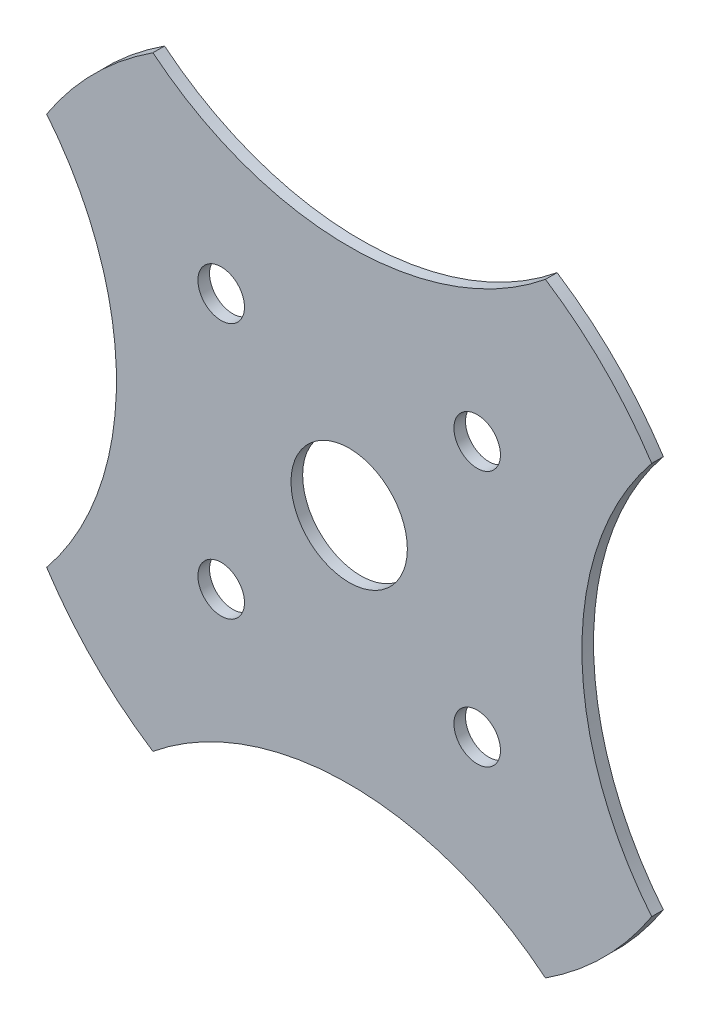
ISO-10303-21;
HEADER;
FILE_DESCRIPTION(('STEP AP214'),'2;1');
FILE_NAME('part.step','',(''),(''),'','','');
FILE_SCHEMA(('AUTOMOTIVE_DESIGN { 1 0 10303 214 1 1 1 1 }'));
ENDSEC;
DATA;
#1=APPLICATION_CONTEXT('core data for automotive mechanical design processes');
#2=APPLICATION_PROTOCOL_DEFINITION('international standard','automotive_design',2000,#1);
#3=PRODUCT_CONTEXT('',#1,'mechanical');
#4=PRODUCT('Part','Part','',(#3));
#5=PRODUCT_RELATED_PRODUCT_CATEGORY('part','',(#4));
#6=PRODUCT_DEFINITION_FORMATION('','',#4);
#7=PRODUCT_DEFINITION_CONTEXT('part definition',#1,'design');
#8=PRODUCT_DEFINITION('design','',#6,#7);
#9=PRODUCT_DEFINITION_SHAPE('','',#8);
#10=(LENGTH_UNIT() NAMED_UNIT(*) SI_UNIT(.MILLI.,.METRE.));
#11=(NAMED_UNIT(*) PLANE_ANGLE_UNIT() SI_UNIT($,.RADIAN.));
#12=(NAMED_UNIT(*) SI_UNIT($,.STERADIAN.) SOLID_ANGLE_UNIT());
#13=UNCERTAINTY_MEASURE_WITH_UNIT(LENGTH_MEASURE(1.E-05),#10,'distance_accuracy_value','');
#14=(GEOMETRIC_REPRESENTATION_CONTEXT(3) GLOBAL_UNCERTAINTY_ASSIGNED_CONTEXT((#13)) GLOBAL_UNIT_ASSIGNED_CONTEXT((#10,
#11,#12)) REPRESENTATION_CONTEXT('',''));
#15=CARTESIAN_POINT('',(0.,0.,0.));
#16=DIRECTION('',(0.,0.,1.));
#17=DIRECTION('',(1.,0.,0.));
#18=AXIS2_PLACEMENT_3D('',#15,#16,#17);
#19=CARTESIAN_POINT('',(0.,0.,-3.175));
#20=DIRECTION('',(0.,0.,1.));
#21=DIRECTION('',(1.,0.,0.));
#22=AXIS2_PLACEMENT_3D('',#19,#20,#21);
#23=CYLINDRICAL_SURFACE('',#22,98.3996);
#24=CARTESIAN_POINT('',(0.,0.,0.));
#25=DIRECTION('',(0.,0.,1.));
#26=DIRECTION('',(1.,0.,0.));
#27=AXIS2_PLACEMENT_3D('',#24,#25,#26);
#28=CIRCLE('',#27,98.3996);
#29=CARTESIAN_POINT('',(82.55,53.5535132382554,0.));
#30=VERTEX_POINT('',#29);
#31=CARTESIAN_POINT('',(53.5535132382553,82.5500000000001,0.));
#32=VERTEX_POINT('',#31);
#33=EDGE_CURVE('E128',#30,#32,#28,.T.);
#34=ORIENTED_EDGE('',*,*,#33,.F.);
#35=DIRECTION('',(0.,0.,1.));
#36=VECTOR('',#35,1.);
#37=CARTESIAN_POINT('',(82.55,53.5535132382554,-3.175));
#38=LINE('',#37,#36);
#39=CARTESIAN_POINT('',(82.55,53.5535132382554,-3.175));
#40=VERTEX_POINT('',#39);
#41=EDGE_CURVE('E11',#40,#30,#38,.T.);
#42=ORIENTED_EDGE('',*,*,#41,.F.);
#43=CARTESIAN_POINT('',(0.,0.,-3.175));
#44=DIRECTION('',(0.,0.,1.));
#45=DIRECTION('',(1.,0.,0.));
#46=AXIS2_PLACEMENT_3D('',#43,#44,#45);
#47=CIRCLE('',#46,98.3996);
#48=CARTESIAN_POINT('',(53.5535132382553,82.5500000000001,-3.175));
#49=VERTEX_POINT('',#48);
#50=EDGE_CURVE('E149',#40,#49,#47,.T.);
#51=ORIENTED_EDGE('',*,*,#50,.T.);
#52=DIRECTION('',(0.,0.,1.));
#53=VECTOR('',#52,1.);
#54=CARTESIAN_POINT('',(53.5535132382553,82.5500000000001,-3.175));
#55=LINE('',#54,#53);
#56=EDGE_CURVE('E34',#49,#32,#55,.T.);
#57=ORIENTED_EDGE('',*,*,#56,.T.);
#58=EDGE_LOOP('',(#34,#42,#51,#57));
#59=FACE_BOUND('',#58,.T.);
#60=ADVANCED_FACE('F31',(#59),#23,.T.);
#61=CARTESIAN_POINT('',(148.3000336,0.,-3.175));
#62=DIRECTION('',(0.,0.,1.));
#63=DIRECTION('',(1.,0.,0.));
#64=AXIS2_PLACEMENT_3D('',#61,#62,#63);
#65=CYLINDRICAL_SURFACE('',#64,84.8000335999997);
#66=CARTESIAN_POINT('',(148.3000336,0.,0.));
#67=DIRECTION('',(0.,0.,-1.));
#68=DIRECTION('',(1.,0.,0.));
#69=AXIS2_PLACEMENT_3D('',#66,#67,#68);
#70=CIRCLE('',#69,84.8000335999997);
#71=CARTESIAN_POINT('',(82.55,-53.5535132382553,0.));
#72=VERTEX_POINT('',#71);
#73=EDGE_CURVE('E147',#72,#30,#70,.T.);
#74=ORIENTED_EDGE('',*,*,#73,.F.);
#75=DIRECTION('',(0.,0.,1.));
#76=VECTOR('',#75,1.);
#77=CARTESIAN_POINT('',(82.55,-53.5535132382553,-3.175));
#78=LINE('',#77,#76);
#79=CARTESIAN_POINT('',(82.55,-53.5535132382553,-3.175));
#80=VERTEX_POINT('',#79);
#81=EDGE_CURVE('E40',#80,#72,#78,.T.);
#82=ORIENTED_EDGE('',*,*,#81,.F.);
#83=CARTESIAN_POINT('',(148.3000336,0.,-3.175));
#84=DIRECTION('',(0.,0.,-1.));
#85=DIRECTION('',(1.,0.,0.));
#86=AXIS2_PLACEMENT_3D('',#83,#84,#85);
#87=CIRCLE('',#86,84.8000335999997);
#88=EDGE_CURVE('E118',#80,#40,#87,.T.);
#89=ORIENTED_EDGE('',*,*,#88,.T.);
#90=ORIENTED_EDGE('',*,*,#41,.T.);
#91=EDGE_LOOP('',(#74,#82,#89,#90));
#92=FACE_BOUND('',#91,.T.);
#93=ADVANCED_FACE('F161',(#92),#65,.F.);
#94=CARTESIAN_POINT('',(0.,0.,-3.175));
#95=DIRECTION('',(0.,0.,1.));
#96=DIRECTION('',(1.,0.,0.));
#97=AXIS2_PLACEMENT_3D('',#94,#95,#96);
#98=CYLINDRICAL_SURFACE('',#97,98.3995999999999);
#99=CARTESIAN_POINT('',(0.,0.,0.));
#100=DIRECTION('',(0.,0.,1.));
#101=DIRECTION('',(1.,0.,0.));
#102=AXIS2_PLACEMENT_3D('',#99,#100,#101);
#103=CIRCLE('',#102,98.3995999999999);
#104=CARTESIAN_POINT('',(53.5535132382553,-82.55,0.));
#105=VERTEX_POINT('',#104);
#106=EDGE_CURVE('E105',#105,#72,#103,.T.);
#107=ORIENTED_EDGE('',*,*,#106,.F.);
#108=DIRECTION('',(0.,0.,1.));
#109=VECTOR('',#108,1.);
#110=CARTESIAN_POINT('',(53.5535132382553,-82.55,-3.175));
#111=LINE('',#110,#109);
#112=CARTESIAN_POINT('',(53.5535132382553,-82.55,-3.175));
#113=VERTEX_POINT('',#112);
#114=EDGE_CURVE('E100',#113,#105,#111,.T.);
#115=ORIENTED_EDGE('',*,*,#114,.F.);
#116=CARTESIAN_POINT('',(0.,0.,-3.175));
#117=DIRECTION('',(0.,0.,1.));
#118=DIRECTION('',(1.,0.,0.));
#119=AXIS2_PLACEMENT_3D('',#116,#117,#118);
#120=CIRCLE('',#119,98.3995999999999);
#121=EDGE_CURVE('E103',#113,#80,#120,.T.);
#122=ORIENTED_EDGE('',*,*,#121,.T.);
#123=ORIENTED_EDGE('',*,*,#81,.T.);
#124=EDGE_LOOP('',(#107,#115,#122,#123));
#125=FACE_BOUND('',#124,.T.);
#126=ADVANCED_FACE('F102',(#125),#98,.T.);
#127=CARTESIAN_POINT('',(0.,-148.3000336,-3.175));
#128=DIRECTION('',(0.,0.,1.));
#129=DIRECTION('',(1.,0.,0.));
#130=AXIS2_PLACEMENT_3D('',#127,#128,#129);
#131=CYLINDRICAL_SURFACE('',#130,84.8000335999997);
#132=CARTESIAN_POINT('',(0.,-148.3000336,0.));
#133=DIRECTION('',(0.,0.,-1.));
#134=DIRECTION('',(-1.,0.,0.));
#135=AXIS2_PLACEMENT_3D('',#132,#133,#134);
#136=CIRCLE('',#135,84.8000335999997);
#137=CARTESIAN_POINT('',(-53.5535132382553,-82.55,0.));
#138=VERTEX_POINT('',#137);
#139=EDGE_CURVE('E144',#138,#105,#136,.T.);
#140=ORIENTED_EDGE('',*,*,#139,.F.);
#141=DIRECTION('',(0.,0.,1.));
#142=VECTOR('',#141,1.);
#143=CARTESIAN_POINT('',(-53.5535132382553,-82.55,-3.175));
#144=LINE('',#143,#142);
#145=CARTESIAN_POINT('',(-53.5535132382553,-82.55,-3.175));
#146=VERTEX_POINT('',#145);
#147=EDGE_CURVE('E110',#146,#138,#144,.T.);
#148=ORIENTED_EDGE('',*,*,#147,.F.);
#149=CARTESIAN_POINT('',(0.,-148.3000336,-3.175));
#150=DIRECTION('',(0.,0.,-1.));
#151=DIRECTION('',(-1.,0.,0.));
#152=AXIS2_PLACEMENT_3D('',#149,#150,#151);
#153=CIRCLE('',#152,84.8000335999997);
#154=EDGE_CURVE('E116',#146,#113,#153,.T.);
#155=ORIENTED_EDGE('',*,*,#154,.T.);
#156=ORIENTED_EDGE('',*,*,#114,.T.);
#157=EDGE_LOOP('',(#140,#148,#155,#156));
#158=FACE_BOUND('',#157,.T.);
#159=ADVANCED_FACE('F120',(#158),#131,.F.);
#160=CARTESIAN_POINT('',(0.,0.,-3.175));
#161=DIRECTION('',(0.,0.,1.));
#162=DIRECTION('',(1.,0.,0.));
#163=AXIS2_PLACEMENT_3D('',#160,#161,#162);
#164=CYLINDRICAL_SURFACE('',#163,98.3995999999999);
#165=CARTESIAN_POINT('',(0.,0.,0.));
#166=DIRECTION('',(0.,0.,1.));
#167=DIRECTION('',(1.,0.,0.));
#168=AXIS2_PLACEMENT_3D('',#165,#166,#167);
#169=CIRCLE('',#168,98.3995999999999);
#170=CARTESIAN_POINT('',(-82.55,-53.5535132382553,0.));
#171=VERTEX_POINT('',#170);
#172=EDGE_CURVE('E141',#171,#138,#169,.T.);
#173=ORIENTED_EDGE('',*,*,#172,.F.);
#174=DIRECTION('',(0.,0.,1.));
#175=VECTOR('',#174,1.);
#176=CARTESIAN_POINT('',(-82.55,-53.5535132382553,-3.175));
#177=LINE('',#176,#175);
#178=CARTESIAN_POINT('',(-82.55,-53.5535132382553,-3.175));
#179=VERTEX_POINT('',#178);
#180=EDGE_CURVE('E153',#179,#171,#177,.T.);
#181=ORIENTED_EDGE('',*,*,#180,.F.);
#182=CARTESIAN_POINT('',(0.,0.,-3.175));
#183=DIRECTION('',(0.,0.,1.));
#184=DIRECTION('',(1.,0.,0.));
#185=AXIS2_PLACEMENT_3D('',#182,#183,#184);
#186=CIRCLE('',#185,98.3995999999999);
#187=EDGE_CURVE('E121',#179,#146,#186,.T.);
#188=ORIENTED_EDGE('',*,*,#187,.T.);
#189=ORIENTED_EDGE('',*,*,#147,.T.);
#190=EDGE_LOOP('',(#173,#181,#188,#189));
#191=FACE_BOUND('',#190,.T.);
#192=ADVANCED_FACE('F174',(#191),#164,.T.);
#193=CARTESIAN_POINT('',(-148.3000336,0.,-3.175));
#194=DIRECTION('',(0.,0.,1.));
#195=DIRECTION('',(1.,0.,0.));
#196=AXIS2_PLACEMENT_3D('',#193,#194,#195);
#197=CYLINDRICAL_SURFACE('',#196,84.8000335999997);
#198=CARTESIAN_POINT('',(-148.3000336,0.,0.));
#199=DIRECTION('',(0.,0.,-1.));
#200=DIRECTION('',(-1.,0.,0.));
#201=AXIS2_PLACEMENT_3D('',#198,#199,#200);
#202=CIRCLE('',#201,84.8000335999997);
#203=CARTESIAN_POINT('',(-82.55,53.5535132382554,0.));
#204=VERTEX_POINT('',#203);
#205=EDGE_CURVE('E138',#204,#171,#202,.T.);
#206=ORIENTED_EDGE('',*,*,#205,.F.);
#207=DIRECTION('',(0.,0.,1.));
#208=VECTOR('',#207,1.);
#209=CARTESIAN_POINT('',(-82.55,53.5535132382554,-3.175));
#210=LINE('',#209,#208);
#211=CARTESIAN_POINT('',(-82.55,53.5535132382554,-3.175));
#212=VERTEX_POINT('',#211);
#213=EDGE_CURVE('E155',#212,#204,#210,.T.);
#214=ORIENTED_EDGE('',*,*,#213,.F.);
#215=CARTESIAN_POINT('',(-148.3000336,0.,-3.175));
#216=DIRECTION('',(0.,0.,-1.));
#217=DIRECTION('',(-1.,0.,0.));
#218=AXIS2_PLACEMENT_3D('',#215,#216,#217);
#219=CIRCLE('',#218,84.8000335999997);
#220=EDGE_CURVE('E123',#212,#179,#219,.T.);
#221=ORIENTED_EDGE('',*,*,#220,.T.);
#222=ORIENTED_EDGE('',*,*,#180,.T.);
#223=EDGE_LOOP('',(#206,#214,#221,#222));
#224=FACE_BOUND('',#223,.T.);
#225=ADVANCED_FACE('F177',(#224),#197,.F.);
#226=CARTESIAN_POINT('',(0.,0.,-3.175));
#227=DIRECTION('',(0.,0.,1.));
#228=DIRECTION('',(1.,0.,0.));
#229=AXIS2_PLACEMENT_3D('',#226,#227,#228);
#230=CYLINDRICAL_SURFACE('',#229,98.3996);
#231=CARTESIAN_POINT('',(0.,0.,0.));
#232=DIRECTION('',(0.,0.,1.));
#233=DIRECTION('',(-1.,0.,0.));
#234=AXIS2_PLACEMENT_3D('',#231,#232,#233);
#235=CIRCLE('',#234,98.3996);
#236=CARTESIAN_POINT('',(-53.5535132382554,82.55,0.));
#237=VERTEX_POINT('',#236);
#238=EDGE_CURVE('E135',#237,#204,#235,.T.);
#239=ORIENTED_EDGE('',*,*,#238,.F.);
#240=DIRECTION('',(0.,0.,1.));
#241=VECTOR('',#240,1.);
#242=CARTESIAN_POINT('',(-53.5535132382554,82.55,-3.175));
#243=LINE('',#242,#241);
#244=CARTESIAN_POINT('',(-53.5535132382554,82.55,-3.175));
#245=VERTEX_POINT('',#244);
#246=EDGE_CURVE('E156',#245,#237,#243,.T.);
#247=ORIENTED_EDGE('',*,*,#246,.F.);
#248=CARTESIAN_POINT('',(0.,0.,-3.175));
#249=DIRECTION('',(0.,0.,1.));
#250=DIRECTION('',(-1.,0.,0.));
#251=AXIS2_PLACEMENT_3D('',#248,#249,#250);
#252=CIRCLE('',#251,98.3996);
#253=EDGE_CURVE('E253',#245,#212,#252,.T.);
#254=ORIENTED_EDGE('',*,*,#253,.T.);
#255=ORIENTED_EDGE('',*,*,#213,.T.);
#256=EDGE_LOOP('',(#239,#247,#254,#255));
#257=FACE_BOUND('',#256,.T.);
#258=ADVANCED_FACE('F181',(#257),#230,.T.);
#259=CARTESIAN_POINT('',(0.,148.3000336,-3.175));
#260=DIRECTION('',(0.,0.,1.));
#261=DIRECTION('',(1.,0.,0.));
#262=AXIS2_PLACEMENT_3D('',#259,#260,#261);
#263=CYLINDRICAL_SURFACE('',#262,84.8000335999997);
#264=CARTESIAN_POINT('',(0.,148.3000336,0.));
#265=DIRECTION('',(0.,0.,-1.));
#266=DIRECTION('',(1.,0.,0.));
#267=AXIS2_PLACEMENT_3D('',#264,#265,#266);
#268=CIRCLE('',#267,84.8000335999997);
#269=EDGE_CURVE('E131',#32,#237,#268,.T.);
#270=ORIENTED_EDGE('',*,*,#269,.F.);
#271=ORIENTED_EDGE('',*,*,#56,.F.);
#272=CARTESIAN_POINT('',(0.,148.3000336,-3.175));
#273=DIRECTION('',(0.,0.,-1.));
#274=DIRECTION('',(1.,0.,0.));
#275=AXIS2_PLACEMENT_3D('',#272,#273,#274);
#276=CIRCLE('',#275,84.8000335999997);
#277=EDGE_CURVE('E251',#49,#245,#276,.T.);
#278=ORIENTED_EDGE('',*,*,#277,.T.);
#279=ORIENTED_EDGE('',*,*,#246,.T.);
#280=EDGE_LOOP('',(#270,#271,#278,#279));
#281=FACE_BOUND('',#280,.T.);
#282=ADVANCED_FACE('F158',(#281),#263,.F.);
#283=CARTESIAN_POINT('',(0.,74.1500167999999,-3.175));
#284=DIRECTION('',(0.,0.,1.));
#285=DIRECTION('',(1.,0.,0.));
#286=AXIS2_PLACEMENT_3D('',#283,#284,#285);
#287=PLANE('',#286);
#288=CARTESIAN_POINT('',(0.,0.,-3.175));
#289=DIRECTION('',(0.,0.,-1.));
#290=DIRECTION('',(-1.,0.,0.));
#291=AXIS2_PLACEMENT_3D('',#288,#289,#290);
#292=CIRCLE('',#291,15.875);
#293=CARTESIAN_POINT('',(-15.875,0.,-3.175));
#294=VERTEX_POINT('',#293);
#295=EDGE_CURVE('E223',#294,#294,#292,.T.);
#296=ORIENTED_EDGE('',*,*,#295,.F.);
#297=EDGE_LOOP('',(#296));
#298=FACE_BOUND('',#297,.T.);
#299=CARTESIAN_POINT('',(34.925,-34.925,-3.175));
#300=DIRECTION('',(0.,0.,-1.));
#301=DIRECTION('',(-1.,0.,0.));
#302=AXIS2_PLACEMENT_3D('',#299,#300,#301);
#303=CIRCLE('',#302,6.35);
#304=CARTESIAN_POINT('',(28.575,-34.925,-3.175));
#305=VERTEX_POINT('',#304);
#306=EDGE_CURVE('E227',#305,#305,#303,.T.);
#307=ORIENTED_EDGE('',*,*,#306,.F.);
#308=EDGE_LOOP('',(#307));
#309=FACE_BOUND('',#308,.T.);
#310=CARTESIAN_POINT('',(-34.925,-34.925,-3.175));
#311=DIRECTION('',(0.,0.,-1.));
#312=DIRECTION('',(-1.,0.,0.));
#313=AXIS2_PLACEMENT_3D('',#310,#311,#312);
#314=CIRCLE('',#313,6.35);
#315=CARTESIAN_POINT('',(-41.275,-34.925,-3.175));
#316=VERTEX_POINT('',#315);
#317=EDGE_CURVE('E234',#316,#316,#314,.T.);
#318=ORIENTED_EDGE('',*,*,#317,.F.);
#319=EDGE_LOOP('',(#318));
#320=FACE_BOUND('',#319,.T.);
#321=CARTESIAN_POINT('',(-34.925,34.925,-3.175));
#322=DIRECTION('',(0.,0.,-1.));
#323=DIRECTION('',(-1.,0.,0.));
#324=AXIS2_PLACEMENT_3D('',#321,#322,#323);
#325=CIRCLE('',#324,6.35);
#326=CARTESIAN_POINT('',(-41.275,34.925,-3.175));
#327=VERTEX_POINT('',#326);
#328=EDGE_CURVE('E240',#327,#327,#325,.T.);
#329=ORIENTED_EDGE('',*,*,#328,.F.);
#330=EDGE_LOOP('',(#329));
#331=FACE_BOUND('',#330,.T.);
#332=CARTESIAN_POINT('',(34.925,34.925,-3.175));
#333=DIRECTION('',(0.,0.,-1.));
#334=DIRECTION('',(-1.,0.,0.));
#335=AXIS2_PLACEMENT_3D('',#332,#333,#334);
#336=CIRCLE('',#335,6.35);
#337=CARTESIAN_POINT('',(28.575,34.925,-3.175));
#338=VERTEX_POINT('',#337);
#339=EDGE_CURVE('E132',#338,#338,#336,.T.);
#340=ORIENTED_EDGE('',*,*,#339,.F.);
#341=EDGE_LOOP('',(#340));
#342=FACE_BOUND('',#341,.T.);
#343=ORIENTED_EDGE('',*,*,#50,.F.);
#344=ORIENTED_EDGE('',*,*,#88,.F.);
#345=ORIENTED_EDGE('',*,*,#121,.F.);
#346=ORIENTED_EDGE('',*,*,#154,.F.);
#347=ORIENTED_EDGE('',*,*,#187,.F.);
#348=ORIENTED_EDGE('',*,*,#220,.F.);
#349=ORIENTED_EDGE('',*,*,#253,.F.);
#350=ORIENTED_EDGE('',*,*,#277,.F.);
#351=EDGE_LOOP('',(#343,#344,#345,#346,#347,#348,#349,#350));
#352=FACE_BOUND('',#351,.T.);
#353=ADVANCED_FACE('F114',(#298,#309,#320,#331,#342,#352),#287,.F.);
#354=CARTESIAN_POINT('',(0.,74.1500167999999,0.));
#355=DIRECTION('',(0.,0.,1.));
#356=DIRECTION('',(1.,0.,0.));
#357=AXIS2_PLACEMENT_3D('',#354,#355,#356);
#358=PLANE('',#357);
#359=CARTESIAN_POINT('',(0.,0.,0.));
#360=DIRECTION('',(0.,0.,1.));
#361=DIRECTION('',(1.,0.,0.));
#362=AXIS2_PLACEMENT_3D('',#359,#360,#361);
#363=CIRCLE('',#362,15.875);
#364=CARTESIAN_POINT('',(15.875,0.,0.));
#365=VERTEX_POINT('',#364);
#366=EDGE_CURVE('E221',#365,#365,#363,.F.);
#367=ORIENTED_EDGE('',*,*,#366,.T.);
#368=EDGE_LOOP('',(#367));
#369=FACE_BOUND('',#368,.T.);
#370=CARTESIAN_POINT('',(34.925,-34.925,0.));
#371=DIRECTION('',(0.,0.,1.));
#372=DIRECTION('',(1.,0.,0.));
#373=AXIS2_PLACEMENT_3D('',#370,#371,#372);
#374=CIRCLE('',#373,6.35);
#375=CARTESIAN_POINT('',(41.275,-34.925,0.));
#376=VERTEX_POINT('',#375);
#377=EDGE_CURVE('E224',#376,#376,#374,.F.);
#378=ORIENTED_EDGE('',*,*,#377,.T.);
#379=EDGE_LOOP('',(#378));
#380=FACE_BOUND('',#379,.T.);
#381=CARTESIAN_POINT('',(-34.925,-34.925,0.));
#382=DIRECTION('',(0.,0.,1.));
#383=DIRECTION('',(1.,0.,0.));
#384=AXIS2_PLACEMENT_3D('',#381,#382,#383);
#385=CIRCLE('',#384,6.35);
#386=CARTESIAN_POINT('',(-28.575,-34.925,0.));
#387=VERTEX_POINT('',#386);
#388=EDGE_CURVE('E232',#387,#387,#385,.F.);
#389=ORIENTED_EDGE('',*,*,#388,.T.);
#390=EDGE_LOOP('',(#389));
#391=FACE_BOUND('',#390,.T.);
#392=CARTESIAN_POINT('',(-34.925,34.925,0.));
#393=DIRECTION('',(0.,0.,1.));
#394=DIRECTION('',(1.,0.,0.));
#395=AXIS2_PLACEMENT_3D('',#392,#393,#394);
#396=CIRCLE('',#395,6.35);
#397=CARTESIAN_POINT('',(-28.575,34.925,0.));
#398=VERTEX_POINT('',#397);
#399=EDGE_CURVE('E237',#398,#398,#396,.F.);
#400=ORIENTED_EDGE('',*,*,#399,.T.);
#401=EDGE_LOOP('',(#400));
#402=FACE_BOUND('',#401,.T.);
#403=CARTESIAN_POINT('',(34.925,34.925,0.));
#404=DIRECTION('',(0.,0.,1.));
#405=DIRECTION('',(1.,0.,0.));
#406=AXIS2_PLACEMENT_3D('',#403,#404,#405);
#407=CIRCLE('',#406,6.35);
#408=CARTESIAN_POINT('',(41.275,34.925,0.));
#409=VERTEX_POINT('',#408);
#410=EDGE_CURVE('E243',#409,#409,#407,.F.);
#411=ORIENTED_EDGE('',*,*,#410,.T.);
#412=EDGE_LOOP('',(#411));
#413=FACE_BOUND('',#412,.T.);
#414=ORIENTED_EDGE('',*,*,#33,.T.);
#415=ORIENTED_EDGE('',*,*,#269,.T.);
#416=ORIENTED_EDGE('',*,*,#238,.T.);
#417=ORIENTED_EDGE('',*,*,#205,.T.);
#418=ORIENTED_EDGE('',*,*,#172,.T.);
#419=ORIENTED_EDGE('',*,*,#139,.T.);
#420=ORIENTED_EDGE('',*,*,#106,.T.);
#421=ORIENTED_EDGE('',*,*,#73,.T.);
#422=EDGE_LOOP('',(#414,#415,#416,#417,#418,#419,#420,#421));
#423=FACE_BOUND('',#422,.T.);
#424=ADVANCED_FACE('F160',(#369,#380,#391,#402,#413,#423),#358,.T.);
#425=CARTESIAN_POINT('',(34.925,34.925,0.00100000000000013));
#426=DIRECTION('',(0.,0.,-1.));
#427=DIRECTION('',(-1.,0.,0.));
#428=AXIS2_PLACEMENT_3D('',#425,#426,#427);
#429=CYLINDRICAL_SURFACE('',#428,6.35);
#430=ORIENTED_EDGE('',*,*,#410,.F.);
#431=EDGE_LOOP('',(#430));
#432=FACE_BOUND('',#431,.T.);
#433=ORIENTED_EDGE('',*,*,#339,.T.);
#434=EDGE_LOOP('',(#433));
#435=FACE_BOUND('',#434,.T.);
#436=ADVANCED_FACE('F193',(#432,#435),#429,.F.);
#437=CARTESIAN_POINT('',(-34.925,34.925,0.00100000000000013));
#438=DIRECTION('',(0.,0.,-1.));
#439=DIRECTION('',(-1.,0.,0.));
#440=AXIS2_PLACEMENT_3D('',#437,#438,#439);
#441=CYLINDRICAL_SURFACE('',#440,6.35);
#442=ORIENTED_EDGE('',*,*,#399,.F.);
#443=EDGE_LOOP('',(#442));
#444=FACE_BOUND('',#443,.T.);
#445=ORIENTED_EDGE('',*,*,#328,.T.);
#446=EDGE_LOOP('',(#445));
#447=FACE_BOUND('',#446,.T.);
#448=ADVANCED_FACE('F200',(#444,#447),#441,.F.);
#449=CARTESIAN_POINT('',(-34.925,-34.925,0.00100000000000013));
#450=DIRECTION('',(0.,0.,-1.));
#451=DIRECTION('',(-1.,0.,0.));
#452=AXIS2_PLACEMENT_3D('',#449,#450,#451);
#453=CYLINDRICAL_SURFACE('',#452,6.35);
#454=ORIENTED_EDGE('',*,*,#388,.F.);
#455=EDGE_LOOP('',(#454));
#456=FACE_BOUND('',#455,.T.);
#457=ORIENTED_EDGE('',*,*,#317,.T.);
#458=EDGE_LOOP('',(#457));
#459=FACE_BOUND('',#458,.T.);
#460=ADVANCED_FACE('F204',(#456,#459),#453,.F.);
#461=CARTESIAN_POINT('',(34.925,-34.925,0.00100000000000013));
#462=DIRECTION('',(0.,0.,-1.));
#463=DIRECTION('',(-1.,0.,0.));
#464=AXIS2_PLACEMENT_3D('',#461,#462,#463);
#465=CYLINDRICAL_SURFACE('',#464,6.35);
#466=ORIENTED_EDGE('',*,*,#377,.F.);
#467=EDGE_LOOP('',(#466));
#468=FACE_BOUND('',#467,.T.);
#469=ORIENTED_EDGE('',*,*,#306,.T.);
#470=EDGE_LOOP('',(#469));
#471=FACE_BOUND('',#470,.T.);
#472=ADVANCED_FACE('F208',(#468,#471),#465,.F.);
#473=CARTESIAN_POINT('',(0.,0.,0.00100000000000013));
#474=DIRECTION('',(0.,0.,-1.));
#475=DIRECTION('',(-1.,0.,0.));
#476=AXIS2_PLACEMENT_3D('',#473,#474,#475);
#477=CYLINDRICAL_SURFACE('',#476,15.875);
#478=ORIENTED_EDGE('',*,*,#366,.F.);
#479=EDGE_LOOP('',(#478));
#480=FACE_BOUND('',#479,.T.);
#481=ORIENTED_EDGE('',*,*,#295,.T.);
#482=EDGE_LOOP('',(#481));
#483=FACE_BOUND('',#482,.T.);
#484=ADVANCED_FACE('F212',(#480,#483),#477,.F.);
#485=CLOSED_SHELL('',(#60,#93,#126,#159,#192,#225,#258,#282,#353,#424,#436,#448,#460,#472,#484));
#486=MANIFOLD_SOLID_BREP('B2',#485);
#487=ADVANCED_BREP_SHAPE_REPRESENTATION('',(#18,#486),#14);
#488=SHAPE_DEFINITION_REPRESENTATION(#9,#487);
ENDSEC;
END-ISO-10303-21;
